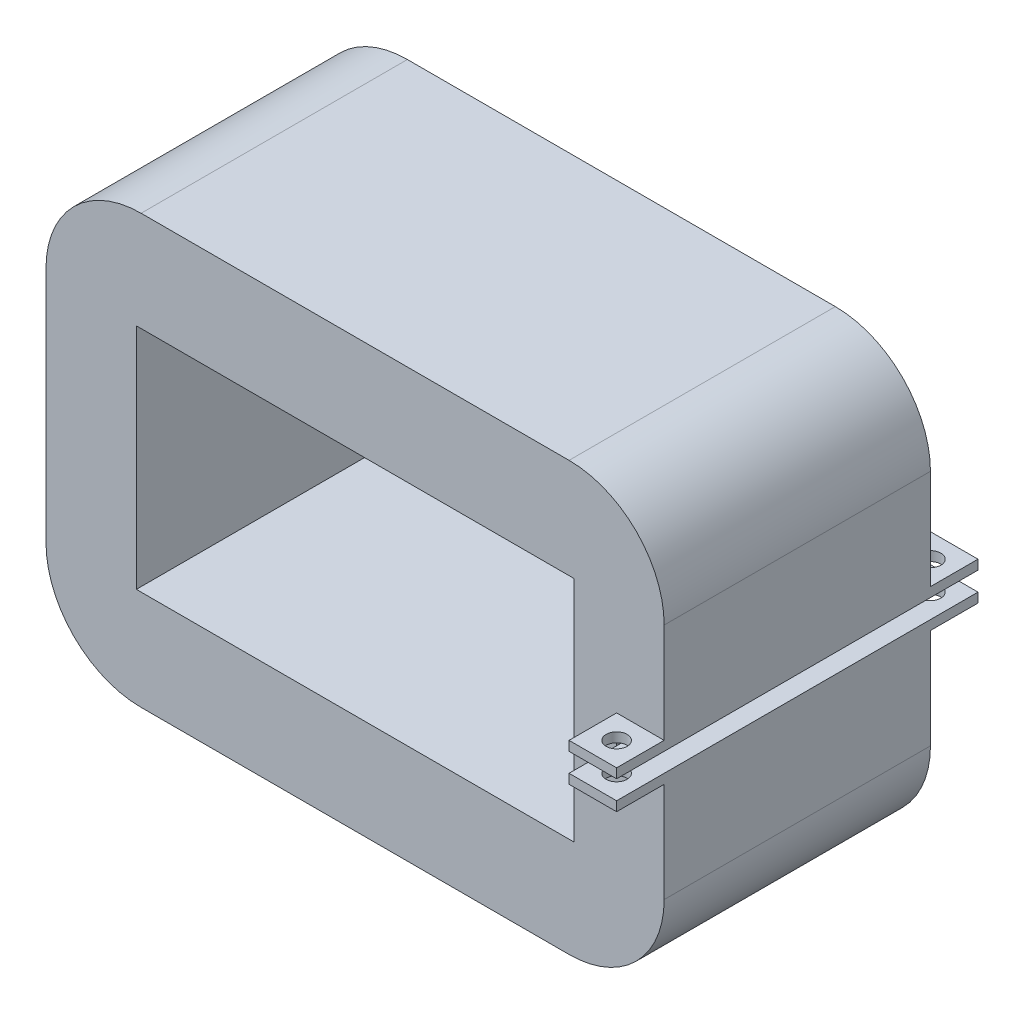
ISO-10303-21;
HEADER;
FILE_DESCRIPTION(('STEP AP214'),'2;1');
FILE_NAME('part.step','',(''),(''),'','','');
FILE_SCHEMA(('AUTOMOTIVE_DESIGN { 1 0 10303 214 1 1 1 1 }'));
ENDSEC;
DATA;
#1=APPLICATION_CONTEXT('core data for automotive mechanical design processes');
#2=APPLICATION_PROTOCOL_DEFINITION('international standard','automotive_design',2000,#1);
#3=PRODUCT_CONTEXT('',#1,'mechanical');
#4=PRODUCT('Part','Part','',(#3));
#5=PRODUCT_RELATED_PRODUCT_CATEGORY('part','',(#4));
#6=PRODUCT_DEFINITION_FORMATION('','',#4);
#7=PRODUCT_DEFINITION_CONTEXT('part definition',#1,'design');
#8=PRODUCT_DEFINITION('design','',#6,#7);
#9=PRODUCT_DEFINITION_SHAPE('','',#8);
#10=(LENGTH_UNIT() NAMED_UNIT(*) SI_UNIT(.MILLI.,.METRE.));
#11=(NAMED_UNIT(*) PLANE_ANGLE_UNIT() SI_UNIT($,.RADIAN.));
#12=(NAMED_UNIT(*) SI_UNIT($,.STERADIAN.) SOLID_ANGLE_UNIT());
#13=UNCERTAINTY_MEASURE_WITH_UNIT(LENGTH_MEASURE(1.E-05),#10,'distance_accuracy_value','');
#14=(GEOMETRIC_REPRESENTATION_CONTEXT(3) GLOBAL_UNCERTAINTY_ASSIGNED_CONTEXT((#13)) GLOBAL_UNIT_ASSIGNED_CONTEXT((#10,
#11,#12)) REPRESENTATION_CONTEXT('',''));
#15=CARTESIAN_POINT('',(0.,0.,0.));
#16=DIRECTION('',(0.,0.,1.));
#17=DIRECTION('',(1.,0.,0.));
#18=AXIS2_PLACEMENT_3D('',#15,#16,#17);
#19=CARTESIAN_POINT('',(5.06534472825042,22.5,28.));
#20=DIRECTION('',(-1.,0.,0.));
#21=DIRECTION('',(0.,-1.,0.));
#22=AXIS2_PLACEMENT_3D('',#19,#20,#21);
#23=PLANE('',#22);
#24=DIRECTION('',(0.,0.,-1.));
#25=VECTOR('',#24,1.);
#26=CARTESIAN_POINT('',(5.06534472825043,-1.,28.));
#27=LINE('',#26,#25);
#28=CARTESIAN_POINT('',(5.06534472825043,-1.,33.));
#29=VERTEX_POINT('',#28);
#30=CARTESIAN_POINT('',(5.06534472825043,-1.,-5.));
#31=VERTEX_POINT('',#30);
#32=EDGE_CURVE('E329',#29,#31,#27,.T.);
#33=ORIENTED_EDGE('',*,*,#32,.F.);
#34=DIRECTION('',(0.,1.,0.));
#35=VECTOR('',#34,1.);
#36=CARTESIAN_POINT('',(5.06534472825043,-1.,33.));
#37=LINE('',#36,#35);
#38=CARTESIAN_POINT('',(5.06534472825043,-2.,33.));
#39=VERTEX_POINT('',#38);
#40=EDGE_CURVE('E506',#39,#29,#37,.T.);
#41=ORIENTED_EDGE('',*,*,#40,.F.);
#42=DIRECTION('',(0.,0.,1.));
#43=VECTOR('',#42,1.);
#44=CARTESIAN_POINT('',(5.06534472825043,-2.,28.));
#45=LINE('',#44,#43);
#46=CARTESIAN_POINT('',(5.06534472825043,-2.,28.));
#47=VERTEX_POINT('',#46);
#48=EDGE_CURVE('E351',#47,#39,#45,.T.);
#49=ORIENTED_EDGE('',*,*,#48,.F.);
#50=DIRECTION('',(0.,1.,0.));
#51=VECTOR('',#50,1.);
#52=CARTESIAN_POINT('',(5.06534472825042,22.5,28.));
#53=LINE('',#52,#51);
#54=CARTESIAN_POINT('',(5.06534472825043,-12.5,28.));
#55=VERTEX_POINT('',#54);
#56=EDGE_CURVE('E243',#55,#47,#53,.T.);
#57=ORIENTED_EDGE('',*,*,#56,.F.);
#58=DIRECTION('',(0.,0.,1.));
#59=VECTOR('',#58,1.);
#60=CARTESIAN_POINT('',(5.06534472825043,-12.5,28.));
#61=LINE('',#60,#59);
#62=CARTESIAN_POINT('',(5.06534472825043,-12.5,0.));
#63=VERTEX_POINT('',#62);
#64=EDGE_CURVE('E319',#55,#63,#61,.F.);
#65=ORIENTED_EDGE('',*,*,#64,.T.);
#66=DIRECTION('',(0.,1.,0.));
#67=VECTOR('',#66,1.);
#68=CARTESIAN_POINT('',(5.06534472825042,22.5,0.));
#69=LINE('',#68,#67);
#70=CARTESIAN_POINT('',(5.06534472825043,-1.99999999999999,0.));
#71=VERTEX_POINT('',#70);
#72=EDGE_CURVE('E266',#63,#71,#69,.T.);
#73=ORIENTED_EDGE('',*,*,#72,.T.);
#74=DIRECTION('',(0.,0.,1.));
#75=VECTOR('',#74,1.);
#76=CARTESIAN_POINT('',(5.06534472825043,-2.,-5.));
#77=LINE('',#76,#75);
#78=CARTESIAN_POINT('',(5.06534472825043,-2.,-5.));
#79=VERTEX_POINT('',#78);
#80=EDGE_CURVE('E421',#79,#71,#77,.T.);
#81=ORIENTED_EDGE('',*,*,#80,.F.);
#82=DIRECTION('',(0.,1.,0.));
#83=VECTOR('',#82,1.);
#84=CARTESIAN_POINT('',(5.06534472825043,-1.,-5.));
#85=LINE('',#84,#83);
#86=EDGE_CURVE('E402',#79,#31,#85,.T.);
#87=ORIENTED_EDGE('',*,*,#86,.T.);
#88=EDGE_LOOP('',(#33,#41,#49,#57,#65,#73,#81,#87));
#89=FACE_BOUND('',#88,.T.);
#90=ADVANCED_FACE('F38',(#89),#23,.F.);
#91=CARTESIAN_POINT('',(-4.93465527174958,-12.5,28.));
#92=DIRECTION('',(0.,0.,1.));
#93=DIRECTION('',(1.,0.,0.));
#94=AXIS2_PLACEMENT_3D('',#91,#92,#93);
#95=CYLINDRICAL_SURFACE('',#94,10.);
#96=DIRECTION('',(0.,0.,1.));
#97=VECTOR('',#96,1.);
#98=CARTESIAN_POINT('',(-4.93465527174958,-22.5,28.));
#99=LINE('',#98,#97);
#100=CARTESIAN_POINT('',(-4.93465527174957,-22.5,0.));
#101=VERTEX_POINT('',#100);
#102=CARTESIAN_POINT('',(-4.93465527174957,-22.5,28.));
#103=VERTEX_POINT('',#102);
#104=EDGE_CURVE('E315',#101,#103,#99,.T.);
#105=ORIENTED_EDGE('',*,*,#104,.F.);
#106=CARTESIAN_POINT('',(-4.93465527174958,-12.5,0.));
#107=DIRECTION('',(0.,0.,1.));
#108=DIRECTION('',(1.,0.,0.));
#109=AXIS2_PLACEMENT_3D('',#106,#107,#108);
#110=CIRCLE('',#109,10.);
#111=EDGE_CURVE('E323',#63,#101,#110,.F.);
#112=ORIENTED_EDGE('',*,*,#111,.F.);
#113=ORIENTED_EDGE('',*,*,#64,.F.);
#114=CARTESIAN_POINT('',(-4.93465527174958,-12.5,28.));
#115=DIRECTION('',(0.,0.,1.));
#116=DIRECTION('',(1.,0.,0.));
#117=AXIS2_PLACEMENT_3D('',#114,#115,#116);
#118=CIRCLE('',#117,10.);
#119=EDGE_CURVE('E326',#103,#55,#118,.T.);
#120=ORIENTED_EDGE('',*,*,#119,.F.);
#121=EDGE_LOOP('',(#105,#112,#113,#120));
#122=FACE_BOUND('',#121,.T.);
#123=ADVANCED_FACE('F40',(#122),#95,.T.);
#124=CARTESIAN_POINT('',(-4.93465527174958,12.5,28.));
#125=DIRECTION('',(0.,0.,-1.));
#126=DIRECTION('',(-1.,0.,0.));
#127=AXIS2_PLACEMENT_3D('',#124,#125,#126);
#128=CYLINDRICAL_SURFACE('',#127,10.);
#129=DIRECTION('',(0.,0.,-1.));
#130=VECTOR('',#129,1.);
#131=CARTESIAN_POINT('',(-4.93465527174958,22.5,28.));
#132=LINE('',#131,#130);
#133=CARTESIAN_POINT('',(-4.93465527174958,22.5,28.));
#134=VERTEX_POINT('',#133);
#135=CARTESIAN_POINT('',(-4.93465527174958,22.5,0.));
#136=VERTEX_POINT('',#135);
#137=EDGE_CURVE('E302',#134,#136,#132,.T.);
#138=ORIENTED_EDGE('',*,*,#137,.F.);
#139=CARTESIAN_POINT('',(-4.93465527174958,12.5,28.));
#140=DIRECTION('',(0.,0.,1.));
#141=DIRECTION('',(1.,0.,0.));
#142=AXIS2_PLACEMENT_3D('',#139,#140,#141);
#143=CIRCLE('',#142,10.);
#144=CARTESIAN_POINT('',(5.06534472825042,12.5,28.));
#145=VERTEX_POINT('',#144);
#146=EDGE_CURVE('E308',#145,#134,#143,.T.);
#147=ORIENTED_EDGE('',*,*,#146,.F.);
#148=DIRECTION('',(0.,0.,-1.));
#149=VECTOR('',#148,1.);
#150=CARTESIAN_POINT('',(5.06534472825042,12.5,28.));
#151=LINE('',#150,#149);
#152=CARTESIAN_POINT('',(5.06534472825042,12.5,0.));
#153=VERTEX_POINT('',#152);
#154=EDGE_CURVE('E241',#153,#145,#151,.F.);
#155=ORIENTED_EDGE('',*,*,#154,.F.);
#156=CARTESIAN_POINT('',(-4.93465527174958,12.5,0.));
#157=DIRECTION('',(0.,0.,1.));
#158=DIRECTION('',(1.,0.,0.));
#159=AXIS2_PLACEMENT_3D('',#156,#157,#158);
#160=CIRCLE('',#159,10.);
#161=EDGE_CURVE('E311',#136,#153,#160,.F.);
#162=ORIENTED_EDGE('',*,*,#161,.F.);
#163=EDGE_LOOP('',(#138,#147,#155,#162));
#164=FACE_BOUND('',#163,.T.);
#165=ADVANCED_FACE('F609',(#164),#128,.T.);
#166=CARTESIAN_POINT('',(-49.9346552717496,12.5,28.));
#167=DIRECTION('',(0.,0.,1.));
#168=DIRECTION('',(1.,0.,0.));
#169=AXIS2_PLACEMENT_3D('',#166,#167,#168);
#170=CYLINDRICAL_SURFACE('',#169,10.);
#171=DIRECTION('',(0.,0.,1.));
#172=VECTOR('',#171,1.);
#173=CARTESIAN_POINT('',(-49.9346552717496,22.5,28.));
#174=LINE('',#173,#172);
#175=CARTESIAN_POINT('',(-49.9346552717496,22.5,0.));
#176=VERTEX_POINT('',#175);
#177=CARTESIAN_POINT('',(-49.9346552717496,22.5,28.));
#178=VERTEX_POINT('',#177);
#179=EDGE_CURVE('E287',#176,#178,#174,.T.);
#180=ORIENTED_EDGE('',*,*,#179,.F.);
#181=CARTESIAN_POINT('',(-49.9346552717496,12.5,0.));
#182=DIRECTION('',(0.,0.,1.));
#183=DIRECTION('',(1.,0.,0.));
#184=AXIS2_PLACEMENT_3D('',#181,#182,#183);
#185=CIRCLE('',#184,10.);
#186=CARTESIAN_POINT('',(-59.9346552717496,12.5,0.));
#187=VERTEX_POINT('',#186);
#188=EDGE_CURVE('E295',#187,#176,#185,.F.);
#189=ORIENTED_EDGE('',*,*,#188,.F.);
#190=DIRECTION('',(0.,0.,1.));
#191=VECTOR('',#190,1.);
#192=CARTESIAN_POINT('',(-59.9346552717496,12.5,28.));
#193=LINE('',#192,#191);
#194=CARTESIAN_POINT('',(-59.9346552717496,12.5,28.));
#195=VERTEX_POINT('',#194);
#196=EDGE_CURVE('E291',#195,#187,#193,.F.);
#197=ORIENTED_EDGE('',*,*,#196,.F.);
#198=CARTESIAN_POINT('',(-49.9346552717496,12.5,28.));
#199=DIRECTION('',(0.,0.,1.));
#200=DIRECTION('',(1.,0.,0.));
#201=AXIS2_PLACEMENT_3D('',#198,#199,#200);
#202=CIRCLE('',#201,10.);
#203=EDGE_CURVE('E299',#178,#195,#202,.T.);
#204=ORIENTED_EDGE('',*,*,#203,.F.);
#205=EDGE_LOOP('',(#180,#189,#197,#204));
#206=FACE_BOUND('',#205,.T.);
#207=ADVANCED_FACE('F627',(#206),#170,.T.);
#208=CARTESIAN_POINT('',(-49.9346552717496,-12.5,28.));
#209=DIRECTION('',(0.,0.,1.));
#210=DIRECTION('',(1.,0.,0.));
#211=AXIS2_PLACEMENT_3D('',#208,#209,#210);
#212=CYLINDRICAL_SURFACE('',#211,10.);
#213=DIRECTION('',(0.,0.,1.));
#214=VECTOR('',#213,1.);
#215=CARTESIAN_POINT('',(-59.9346552717496,-12.5,28.));
#216=LINE('',#215,#214);
#217=CARTESIAN_POINT('',(-59.9346552717496,-12.5,0.));
#218=VERTEX_POINT('',#217);
#219=CARTESIAN_POINT('',(-59.9346552717496,-12.5,28.));
#220=VERTEX_POINT('',#219);
#221=EDGE_CURVE('E256',#218,#220,#216,.T.);
#222=ORIENTED_EDGE('',*,*,#221,.F.);
#223=CARTESIAN_POINT('',(-49.9346552717496,-12.5,0.));
#224=DIRECTION('',(0.,0.,1.));
#225=DIRECTION('',(1.,0.,0.));
#226=AXIS2_PLACEMENT_3D('',#223,#224,#225);
#227=CIRCLE('',#226,10.);
#228=CARTESIAN_POINT('',(-49.9346552717496,-22.5,0.));
#229=VERTEX_POINT('',#228);
#230=EDGE_CURVE('E280',#229,#218,#227,.F.);
#231=ORIENTED_EDGE('',*,*,#230,.F.);
#232=DIRECTION('',(0.,0.,1.));
#233=VECTOR('',#232,1.);
#234=CARTESIAN_POINT('',(-49.9346552717496,-22.5,28.));
#235=LINE('',#234,#233);
#236=CARTESIAN_POINT('',(-49.9346552717496,-22.5,28.));
#237=VERTEX_POINT('',#236);
#238=EDGE_CURVE('E276',#237,#229,#235,.F.);
#239=ORIENTED_EDGE('',*,*,#238,.F.);
#240=CARTESIAN_POINT('',(-49.9346552717496,-12.5,28.));
#241=DIRECTION('',(0.,0.,1.));
#242=DIRECTION('',(1.,0.,0.));
#243=AXIS2_PLACEMENT_3D('',#240,#241,#242);
#244=CIRCLE('',#243,10.);
#245=EDGE_CURVE('E284',#220,#237,#244,.T.);
#246=ORIENTED_EDGE('',*,*,#245,.F.);
#247=EDGE_LOOP('',(#222,#231,#239,#246));
#248=FACE_BOUND('',#247,.T.);
#249=ADVANCED_FACE('F488',(#248),#212,.T.);
#250=CARTESIAN_POINT('',(0.,0.,28.));
#251=DIRECTION('',(0.,0.,1.));
#252=DIRECTION('',(1.,0.,0.));
#253=AXIS2_PLACEMENT_3D('',#250,#251,#252);
#254=PLANE('',#253);
#255=DIRECTION('',(0.,-1.,0.));
#256=VECTOR('',#255,1.);
#257=CARTESIAN_POINT('',(0.0653447282504237,1.,28.));
#258=LINE('',#257,#256);
#259=CARTESIAN_POINT('',(0.0653447282504237,2.,28.));
#260=VERTEX_POINT('',#259);
#261=CARTESIAN_POINT('',(0.0653447282504237,1.,28.));
#262=VERTEX_POINT('',#261);
#263=EDGE_CURVE('E235',#260,#262,#258,.T.);
#264=ORIENTED_EDGE('',*,*,#263,.F.);
#265=DIRECTION('',(-1.,0.,0.));
#266=VECTOR('',#265,1.);
#267=CARTESIAN_POINT('',(0.0653447282504237,2.,28.));
#268=LINE('',#267,#266);
#269=CARTESIAN_POINT('',(5.06534472825042,2.,28.));
#270=VERTEX_POINT('',#269);
#271=EDGE_CURVE('E218',#270,#260,#268,.T.);
#272=ORIENTED_EDGE('',*,*,#271,.F.);
#273=EDGE_CURVE('E232',#270,#145,#53,.T.);
#274=ORIENTED_EDGE('',*,*,#273,.T.);
#275=ORIENTED_EDGE('',*,*,#146,.T.);
#276=DIRECTION('',(-1.,0.,0.));
#277=VECTOR('',#276,1.);
#278=CARTESIAN_POINT('',(-59.9346552717496,22.5,28.));
#279=LINE('',#278,#277);
#280=EDGE_CURVE('E248',#134,#178,#279,.T.);
#281=ORIENTED_EDGE('',*,*,#280,.T.);
#282=ORIENTED_EDGE('',*,*,#203,.T.);
#283=DIRECTION('',(0.,-1.,0.));
#284=VECTOR('',#283,1.);
#285=CARTESIAN_POINT('',(-59.9346552717496,22.5,28.));
#286=LINE('',#285,#284);
#287=EDGE_CURVE('E250',#195,#220,#286,.T.);
#288=ORIENTED_EDGE('',*,*,#287,.T.);
#289=ORIENTED_EDGE('',*,*,#245,.T.);
#290=DIRECTION('',(1.,0.,0.));
#291=VECTOR('',#290,1.);
#292=CARTESIAN_POINT('',(-59.9346552717496,-22.5,28.));
#293=LINE('',#292,#291);
#294=EDGE_CURVE('E244',#237,#103,#293,.T.);
#295=ORIENTED_EDGE('',*,*,#294,.T.);
#296=ORIENTED_EDGE('',*,*,#119,.T.);
#297=ORIENTED_EDGE('',*,*,#56,.T.);
#298=DIRECTION('',(1.,0.,0.));
#299=VECTOR('',#298,1.);
#300=CARTESIAN_POINT('',(0.0653447282504238,-2.,28.));
#301=LINE('',#300,#299);
#302=CARTESIAN_POINT('',(0.0653447282504238,-2.,28.));
#303=VERTEX_POINT('',#302);
#304=EDGE_CURVE('E56',#303,#47,#301,.T.);
#305=ORIENTED_EDGE('',*,*,#304,.F.);
#306=DIRECTION('',(0.,-1.,0.));
#307=VECTOR('',#306,1.);
#308=CARTESIAN_POINT('',(0.0653447282504236,-1.,28.));
#309=LINE('',#308,#307);
#310=CARTESIAN_POINT('',(0.0653447282504236,-1.,28.));
#311=VERTEX_POINT('',#310);
#312=EDGE_CURVE('E514',#311,#303,#309,.T.);
#313=ORIENTED_EDGE('',*,*,#312,.F.);
#314=DIRECTION('',(0.,1.,0.));
#315=VECTOR('',#314,1.);
#316=CARTESIAN_POINT('',(0.0653447282504237,0.,28.));
#317=LINE('',#316,#315);
#318=EDGE_CURVE('E433',#311,#262,#317,.T.);
#319=ORIENTED_EDGE('',*,*,#318,.T.);
#320=EDGE_LOOP('',(#264,#272,#274,#275,#281,#282,#288,#289,#295,#296,#297,#305,#313,#319));
#321=FACE_BOUND('',#320,.T.);
#322=DIRECTION('',(-1.,0.,0.));
#323=VECTOR('',#322,1.);
#324=CARTESIAN_POINT('',(0.,-12.,28.));
#325=LINE('',#324,#323);
#326=CARTESIAN_POINT('',(-4.43465527174957,-12.,28.));
#327=VERTEX_POINT('',#326);
#328=CARTESIAN_POINT('',(-50.4346552717496,-12.,28.));
#329=VERTEX_POINT('',#328);
#330=EDGE_CURVE('E473',#327,#329,#325,.T.);
#331=ORIENTED_EDGE('',*,*,#330,.T.);
#332=DIRECTION('',(0.,1.,0.));
#333=VECTOR('',#332,1.);
#334=CARTESIAN_POINT('',(-50.4346552717496,0.,28.));
#335=LINE('',#334,#333);
#336=CARTESIAN_POINT('',(-50.4346552717496,12.,28.));
#337=VERTEX_POINT('',#336);
#338=EDGE_CURVE('E261',#329,#337,#335,.T.);
#339=ORIENTED_EDGE('',*,*,#338,.T.);
#340=DIRECTION('',(1.,0.,0.));
#341=VECTOR('',#340,1.);
#342=CARTESIAN_POINT('',(0.,12.,28.));
#343=LINE('',#342,#341);
#344=CARTESIAN_POINT('',(-4.43465527174958,12.,28.));
#345=VERTEX_POINT('',#344);
#346=EDGE_CURVE('E465',#337,#345,#343,.T.);
#347=ORIENTED_EDGE('',*,*,#346,.T.);
#348=DIRECTION('',(0.,-1.,0.));
#349=VECTOR('',#348,1.);
#350=CARTESIAN_POINT('',(-4.43465527174958,0.,28.));
#351=LINE('',#350,#349);
#352=EDGE_CURVE('E469',#345,#327,#351,.T.);
#353=ORIENTED_EDGE('',*,*,#352,.T.);
#354=EDGE_LOOP('',(#331,#339,#347,#353));
#355=FACE_BOUND('',#354,.T.);
#356=ADVANCED_FACE('F230',(#321,#355),#254,.T.);
#357=CARTESIAN_POINT('',(0.,0.,0.));
#358=DIRECTION('',(0.,0.,1.));
#359=DIRECTION('',(1.,0.,0.));
#360=AXIS2_PLACEMENT_3D('',#357,#358,#359);
#361=PLANE('',#360);
#362=DIRECTION('',(-1.,0.,0.));
#363=VECTOR('',#362,1.);
#364=CARTESIAN_POINT('',(0.0653447282504237,2.,0.));
#365=LINE('',#364,#363);
#366=CARTESIAN_POINT('',(5.06534472825042,2.00000000000001,0.));
#367=VERTEX_POINT('',#366);
#368=CARTESIAN_POINT('',(0.0653447282504237,2.,0.));
#369=VERTEX_POINT('',#368);
#370=EDGE_CURVE('E64',#367,#369,#365,.T.);
#371=ORIENTED_EDGE('',*,*,#370,.T.);
#372=DIRECTION('',(0.,-1.,0.));
#373=VECTOR('',#372,1.);
#374=CARTESIAN_POINT('',(0.0653447282504237,1.,0.));
#375=LINE('',#374,#373);
#376=CARTESIAN_POINT('',(0.0653447282504237,1.,0.));
#377=VERTEX_POINT('',#376);
#378=EDGE_CURVE('E360',#369,#377,#375,.T.);
#379=ORIENTED_EDGE('',*,*,#378,.T.);
#380=DIRECTION('',(0.,1.,0.));
#381=VECTOR('',#380,1.);
#382=CARTESIAN_POINT('',(0.0653447282504237,0.,0.));
#383=LINE('',#382,#381);
#384=CARTESIAN_POINT('',(0.0653447282504236,-1.,0.));
#385=VERTEX_POINT('',#384);
#386=EDGE_CURVE('E11',#385,#377,#383,.T.);
#387=ORIENTED_EDGE('',*,*,#386,.F.);
#388=DIRECTION('',(0.,-1.,0.));
#389=VECTOR('',#388,1.);
#390=CARTESIAN_POINT('',(0.0653447282504236,-1.,0.));
#391=LINE('',#390,#389);
#392=CARTESIAN_POINT('',(0.0653447282504238,-2.,0.));
#393=VERTEX_POINT('',#392);
#394=EDGE_CURVE('E385',#385,#393,#391,.T.);
#395=ORIENTED_EDGE('',*,*,#394,.T.);
#396=DIRECTION('',(1.,0.,0.));
#397=VECTOR('',#396,1.);
#398=CARTESIAN_POINT('',(0.0653447282504238,-2.,0.));
#399=LINE('',#398,#397);
#400=EDGE_CURVE('E398',#393,#71,#399,.T.);
#401=ORIENTED_EDGE('',*,*,#400,.T.);
#402=ORIENTED_EDGE('',*,*,#72,.F.);
#403=ORIENTED_EDGE('',*,*,#111,.T.);
#404=DIRECTION('',(1.,0.,0.));
#405=VECTOR('',#404,1.);
#406=CARTESIAN_POINT('',(-59.9346552717496,-22.5,0.));
#407=LINE('',#406,#405);
#408=EDGE_CURVE('E260',#229,#101,#407,.T.);
#409=ORIENTED_EDGE('',*,*,#408,.F.);
#410=ORIENTED_EDGE('',*,*,#230,.T.);
#411=DIRECTION('',(0.,-1.,0.));
#412=VECTOR('',#411,1.);
#413=CARTESIAN_POINT('',(-59.9346552717496,22.5,0.));
#414=LINE('',#413,#412);
#415=EDGE_CURVE('E257',#187,#218,#414,.T.);
#416=ORIENTED_EDGE('',*,*,#415,.F.);
#417=ORIENTED_EDGE('',*,*,#188,.T.);
#418=DIRECTION('',(-1.,0.,0.));
#419=VECTOR('',#418,1.);
#420=CARTESIAN_POINT('',(-59.9346552717496,22.5,0.));
#421=LINE('',#420,#419);
#422=EDGE_CURVE('E270',#136,#176,#421,.T.);
#423=ORIENTED_EDGE('',*,*,#422,.F.);
#424=ORIENTED_EDGE('',*,*,#161,.T.);
#425=EDGE_CURVE('E265',#367,#153,#69,.T.);
#426=ORIENTED_EDGE('',*,*,#425,.F.);
#427=EDGE_LOOP('',(#371,#379,#387,#395,#401,#402,#403,#409,#410,#416,#417,#423,#424,#426));
#428=FACE_BOUND('',#427,.T.);
#429=DIRECTION('',(0.,-1.,0.));
#430=VECTOR('',#429,1.);
#431=CARTESIAN_POINT('',(-50.4346552717496,12.,0.));
#432=LINE('',#431,#430);
#433=CARTESIAN_POINT('',(-50.4346552717496,12.,0.));
#434=VERTEX_POINT('',#433);
#435=CARTESIAN_POINT('',(-50.4346552717496,-12.,0.));
#436=VERTEX_POINT('',#435);
#437=EDGE_CURVE('E436',#434,#436,#432,.T.);
#438=ORIENTED_EDGE('',*,*,#437,.T.);
#439=DIRECTION('',(1.,0.,0.));
#440=VECTOR('',#439,1.);
#441=CARTESIAN_POINT('',(-50.4346552717496,-12.,0.));
#442=LINE('',#441,#440);
#443=CARTESIAN_POINT('',(-4.43465527174957,-12.,0.));
#444=VERTEX_POINT('',#443);
#445=EDGE_CURVE('E440',#436,#444,#442,.T.);
#446=ORIENTED_EDGE('',*,*,#445,.T.);
#447=DIRECTION('',(0.,1.,0.));
#448=VECTOR('',#447,1.);
#449=CARTESIAN_POINT('',(-4.43465527174958,12.,0.));
#450=LINE('',#449,#448);
#451=CARTESIAN_POINT('',(-4.43465527174958,12.,0.));
#452=VERTEX_POINT('',#451);
#453=EDGE_CURVE('E444',#444,#452,#450,.T.);
#454=ORIENTED_EDGE('',*,*,#453,.T.);
#455=DIRECTION('',(-1.,0.,0.));
#456=VECTOR('',#455,1.);
#457=CARTESIAN_POINT('',(-50.4346552717496,12.,0.));
#458=LINE('',#457,#456);
#459=EDGE_CURVE('E448',#452,#434,#458,.T.);
#460=ORIENTED_EDGE('',*,*,#459,.T.);
#461=EDGE_LOOP('',(#438,#446,#454,#460));
#462=FACE_BOUND('',#461,.T.);
#463=ADVANCED_FACE('F493',(#428,#462),#361,.F.);
#464=CARTESIAN_POINT('',(-59.9346552717496,22.5,28.));
#465=DIRECTION('',(1.,0.,0.));
#466=DIRECTION('',(0.,1.,0.));
#467=AXIS2_PLACEMENT_3D('',#464,#465,#466);
#468=PLANE('',#467);
#469=ORIENTED_EDGE('',*,*,#287,.F.);
#470=ORIENTED_EDGE('',*,*,#196,.T.);
#471=ORIENTED_EDGE('',*,*,#415,.T.);
#472=ORIENTED_EDGE('',*,*,#221,.T.);
#473=EDGE_LOOP('',(#469,#470,#471,#472));
#474=FACE_BOUND('',#473,.T.);
#475=ADVANCED_FACE('F490',(#474),#468,.F.);
#476=CARTESIAN_POINT('',(-59.9346552717496,-22.5,28.));
#477=DIRECTION('',(0.,1.,0.));
#478=DIRECTION('',(0.,0.,1.));
#479=AXIS2_PLACEMENT_3D('',#476,#477,#478);
#480=PLANE('',#479);
#481=ORIENTED_EDGE('',*,*,#408,.T.);
#482=ORIENTED_EDGE('',*,*,#104,.T.);
#483=ORIENTED_EDGE('',*,*,#294,.F.);
#484=ORIENTED_EDGE('',*,*,#238,.T.);
#485=EDGE_LOOP('',(#481,#482,#483,#484));
#486=FACE_BOUND('',#485,.T.);
#487=ADVANCED_FACE('F496',(#486),#480,.F.);
#488=ORIENTED_EDGE('',*,*,#273,.F.);
#489=DIRECTION('',(0.,0.,1.));
#490=VECTOR('',#489,1.);
#491=CARTESIAN_POINT('',(5.06534472825042,2.,28.));
#492=LINE('',#491,#490);
#493=CARTESIAN_POINT('',(5.06534472825042,2.,33.));
#494=VERTEX_POINT('',#493);
#495=EDGE_CURVE('E215',#270,#494,#492,.T.);
#496=ORIENTED_EDGE('',*,*,#495,.T.);
#497=DIRECTION('',(0.,1.,0.));
#498=VECTOR('',#497,1.);
#499=CARTESIAN_POINT('',(5.06534472825042,1.,33.));
#500=LINE('',#499,#498);
#501=CARTESIAN_POINT('',(5.06534472825042,1.,33.));
#502=VERTEX_POINT('',#501);
#503=EDGE_CURVE('E563',#502,#494,#500,.T.);
#504=ORIENTED_EDGE('',*,*,#503,.F.);
#505=DIRECTION('',(0.,0.,-1.));
#506=VECTOR('',#505,1.);
#507=CARTESIAN_POINT('',(5.06534472825042,1.,28.));
#508=LINE('',#507,#506);
#509=CARTESIAN_POINT('',(5.06534472825042,1.,-5.));
#510=VERTEX_POINT('',#509);
#511=EDGE_CURVE('E48',#502,#510,#508,.T.);
#512=ORIENTED_EDGE('',*,*,#511,.T.);
#513=DIRECTION('',(0.,1.,0.));
#514=VECTOR('',#513,1.);
#515=CARTESIAN_POINT('',(5.06534472825042,1.,-5.));
#516=LINE('',#515,#514);
#517=CARTESIAN_POINT('',(5.06534472825042,2.,-5.));
#518=VERTEX_POINT('',#517);
#519=EDGE_CURVE('E369',#510,#518,#516,.T.);
#520=ORIENTED_EDGE('',*,*,#519,.T.);
#521=DIRECTION('',(0.,0.,1.));
#522=VECTOR('',#521,1.);
#523=CARTESIAN_POINT('',(5.06534472825042,2.,-5.));
#524=LINE('',#523,#522);
#525=EDGE_CURVE('E386',#518,#367,#524,.T.);
#526=ORIENTED_EDGE('',*,*,#525,.T.);
#527=ORIENTED_EDGE('',*,*,#425,.T.);
#528=ORIENTED_EDGE('',*,*,#154,.T.);
#529=EDGE_LOOP('',(#488,#496,#504,#512,#520,#526,#527,#528));
#530=FACE_BOUND('',#529,.T.);
#531=ADVANCED_FACE('F239',(#530),#23,.F.);
#532=CARTESIAN_POINT('',(-59.9346552717496,22.5,28.));
#533=DIRECTION('',(0.,-1.,0.));
#534=DIRECTION('',(1.,0.,0.));
#535=AXIS2_PLACEMENT_3D('',#532,#533,#534);
#536=PLANE('',#535);
#537=ORIENTED_EDGE('',*,*,#280,.F.);
#538=ORIENTED_EDGE('',*,*,#137,.T.);
#539=ORIENTED_EDGE('',*,*,#422,.T.);
#540=ORIENTED_EDGE('',*,*,#179,.T.);
#541=EDGE_LOOP('',(#537,#538,#539,#540));
#542=FACE_BOUND('',#541,.T.);
#543=ADVANCED_FACE('F613',(#542),#536,.F.);
#544=CARTESIAN_POINT('',(-50.4346552717496,12.,39.));
#545=DIRECTION('',(1.,0.,0.));
#546=DIRECTION('',(0.,0.,-1.));
#547=AXIS2_PLACEMENT_3D('',#544,#545,#546);
#548=PLANE('',#547);
#549=DIRECTION('',(0.,0.,-1.));
#550=VECTOR('',#549,1.);
#551=CARTESIAN_POINT('',(-50.4346552717496,-12.,39.));
#552=LINE('',#551,#550);
#553=EDGE_CURVE('E462',#329,#436,#552,.T.);
#554=ORIENTED_EDGE('',*,*,#553,.T.);
#555=ORIENTED_EDGE('',*,*,#437,.F.);
#556=DIRECTION('',(0.,0.,-1.));
#557=VECTOR('',#556,1.);
#558=CARTESIAN_POINT('',(-50.4346552717496,12.,39.));
#559=LINE('',#558,#557);
#560=EDGE_CURVE('E452',#337,#434,#559,.T.);
#561=ORIENTED_EDGE('',*,*,#560,.F.);
#562=ORIENTED_EDGE('',*,*,#338,.F.);
#563=EDGE_LOOP('',(#554,#555,#561,#562));
#564=FACE_BOUND('',#563,.T.);
#565=ADVANCED_FACE('F618',(#564),#548,.T.);
#566=CARTESIAN_POINT('',(-50.4346552717496,-12.,39.));
#567=DIRECTION('',(0.,1.,0.));
#568=DIRECTION('',(-1.,0.,0.));
#569=AXIS2_PLACEMENT_3D('',#566,#567,#568);
#570=PLANE('',#569);
#571=DIRECTION('',(0.,0.,-1.));
#572=VECTOR('',#571,1.);
#573=CARTESIAN_POINT('',(-4.43465527174957,-12.,39.));
#574=LINE('',#573,#572);
#575=EDGE_CURVE('E459',#327,#444,#574,.T.);
#576=ORIENTED_EDGE('',*,*,#575,.T.);
#577=ORIENTED_EDGE('',*,*,#445,.F.);
#578=ORIENTED_EDGE('',*,*,#553,.F.);
#579=ORIENTED_EDGE('',*,*,#330,.F.);
#580=EDGE_LOOP('',(#576,#577,#578,#579));
#581=FACE_BOUND('',#580,.T.);
#582=ADVANCED_FACE('F687',(#581),#570,.T.);
#583=CARTESIAN_POINT('',(-4.43465527174958,12.,39.));
#584=DIRECTION('',(-1.,0.,0.));
#585=DIRECTION('',(0.,-1.,0.));
#586=AXIS2_PLACEMENT_3D('',#583,#584,#585);
#587=PLANE('',#586);
#588=DIRECTION('',(0.,0.,-1.));
#589=VECTOR('',#588,1.);
#590=CARTESIAN_POINT('',(-4.43465527174958,12.,39.));
#591=LINE('',#590,#589);
#592=EDGE_CURVE('E456',#345,#452,#591,.T.);
#593=ORIENTED_EDGE('',*,*,#592,.T.);
#594=ORIENTED_EDGE('',*,*,#453,.F.);
#595=ORIENTED_EDGE('',*,*,#575,.F.);
#596=ORIENTED_EDGE('',*,*,#352,.F.);
#597=EDGE_LOOP('',(#593,#594,#595,#596));
#598=FACE_BOUND('',#597,.T.);
#599=ADVANCED_FACE('F683',(#598),#587,.T.);
#600=CARTESIAN_POINT('',(-50.4346552717496,12.,39.));
#601=DIRECTION('',(0.,-1.,0.));
#602=DIRECTION('',(0.,0.,-1.));
#603=AXIS2_PLACEMENT_3D('',#600,#601,#602);
#604=PLANE('',#603);
#605=ORIENTED_EDGE('',*,*,#560,.T.);
#606=ORIENTED_EDGE('',*,*,#459,.F.);
#607=ORIENTED_EDGE('',*,*,#592,.F.);
#608=ORIENTED_EDGE('',*,*,#346,.F.);
#609=EDGE_LOOP('',(#605,#606,#607,#608));
#610=FACE_BOUND('',#609,.T.);
#611=ADVANCED_FACE('F680',(#610),#604,.T.);
#612=CARTESIAN_POINT('',(0.0653447282504237,1.,-3.31208002210381));
#613=DIRECTION('',(1.,0.,0.));
#614=DIRECTION('',(0.,1.,0.));
#615=AXIS2_PLACEMENT_3D('',#612,#613,#614);
#616=PLANE('',#615);
#617=DIRECTION('',(0.,0.,1.));
#618=VECTOR('',#617,1.);
#619=CARTESIAN_POINT('',(0.0653447282504236,-1.,-3.31208002210381));
#620=LINE('',#619,#618);
#621=EDGE_CURVE('E420',#385,#311,#620,.T.);
#622=ORIENTED_EDGE('',*,*,#621,.F.);
#623=ORIENTED_EDGE('',*,*,#386,.T.);
#624=DIRECTION('',(0.,0.,1.));
#625=VECTOR('',#624,1.);
#626=CARTESIAN_POINT('',(0.0653447282504237,1.,-3.31208002210381));
#627=LINE('',#626,#625);
#628=EDGE_CURVE('E429',#377,#262,#627,.T.);
#629=ORIENTED_EDGE('',*,*,#628,.T.);
#630=ORIENTED_EDGE('',*,*,#318,.F.);
#631=EDGE_LOOP('',(#622,#623,#629,#630));
#632=FACE_BOUND('',#631,.T.);
#633=ADVANCED_FACE('F545',(#632),#616,.T.);
#634=CARTESIAN_POINT('',(0.,1.,0.));
#635=DIRECTION('',(0.,1.,0.));
#636=DIRECTION('',(-1.,0.,0.));
#637=AXIS2_PLACEMENT_3D('',#634,#635,#636);
#638=PLANE('',#637);
#639=CARTESIAN_POINT('',(2.56534472825042,1.,30.5));
#640=DIRECTION('',(0.,1.,0.));
#641=DIRECTION('',(-1.,0.,0.));
#642=AXIS2_PLACEMENT_3D('',#639,#640,#641);
#643=CIRCLE('',#642,1.1);
#644=CARTESIAN_POINT('',(1.46534472825043,1.,30.5));
#645=VERTEX_POINT('',#644);
#646=EDGE_CURVE('E570',#645,#645,#643,.T.);
#647=ORIENTED_EDGE('',*,*,#646,.T.);
#648=EDGE_LOOP('',(#647));
#649=FACE_BOUND('',#648,.T.);
#650=CARTESIAN_POINT('',(2.56534472825042,1.,-2.5));
#651=DIRECTION('',(0.,1.,0.));
#652=DIRECTION('',(-1.,0.,0.));
#653=AXIS2_PLACEMENT_3D('',#650,#651,#652);
#654=CIRCLE('',#653,1.1);
#655=CARTESIAN_POINT('',(1.46534472825043,1.,-2.5));
#656=VERTEX_POINT('',#655);
#657=EDGE_CURVE('E343',#656,#656,#654,.T.);
#658=ORIENTED_EDGE('',*,*,#657,.T.);
#659=EDGE_LOOP('',(#658));
#660=FACE_BOUND('',#659,.T.);
#661=ORIENTED_EDGE('',*,*,#511,.F.);
#662=DIRECTION('',(1.,0.,0.));
#663=VECTOR('',#662,1.);
#664=CARTESIAN_POINT('',(0.0653447282504237,1.,33.));
#665=LINE('',#664,#663);
#666=CARTESIAN_POINT('',(0.0653447282504237,1.,33.));
#667=VERTEX_POINT('',#666);
#668=EDGE_CURVE('E553',#667,#502,#665,.T.);
#669=ORIENTED_EDGE('',*,*,#668,.F.);
#670=DIRECTION('',(0.,0.,1.));
#671=VECTOR('',#670,1.);
#672=CARTESIAN_POINT('',(0.0653447282504237,1.,28.));
#673=LINE('',#672,#671);
#674=EDGE_CURVE('E228',#262,#667,#673,.T.);
#675=ORIENTED_EDGE('',*,*,#674,.F.);
#676=ORIENTED_EDGE('',*,*,#628,.F.);
#677=DIRECTION('',(0.,0.,1.));
#678=VECTOR('',#677,1.);
#679=CARTESIAN_POINT('',(0.0653447282504237,1.,-5.));
#680=LINE('',#679,#678);
#681=CARTESIAN_POINT('',(0.0653447282504237,1.,-5.));
#682=VERTEX_POINT('',#681);
#683=EDGE_CURVE('E377',#682,#377,#680,.T.);
#684=ORIENTED_EDGE('',*,*,#683,.F.);
#685=DIRECTION('',(1.,0.,0.));
#686=VECTOR('',#685,1.);
#687=CARTESIAN_POINT('',(0.0653447282504237,1.,-5.));
#688=LINE('',#687,#686);
#689=EDGE_CURVE('E365',#682,#510,#688,.T.);
#690=ORIENTED_EDGE('',*,*,#689,.T.);
#691=EDGE_LOOP('',(#661,#669,#675,#676,#684,#690));
#692=FACE_BOUND('',#691,.T.);
#693=ADVANCED_FACE('F549',(#649,#660,#692),#638,.F.);
#694=CARTESIAN_POINT('',(0.,-1.,0.));
#695=DIRECTION('',(0.,1.,0.));
#696=DIRECTION('',(-1.,0.,0.));
#697=AXIS2_PLACEMENT_3D('',#694,#695,#696);
#698=PLANE('',#697);
#699=CARTESIAN_POINT('',(2.56534472825042,-1.,30.5));
#700=DIRECTION('',(0.,1.,0.));
#701=DIRECTION('',(-1.,0.,0.));
#702=AXIS2_PLACEMENT_3D('',#699,#700,#701);
#703=CIRCLE('',#702,1.1);
#704=CARTESIAN_POINT('',(1.46534472825043,-1.,30.5));
#705=VERTEX_POINT('',#704);
#706=EDGE_CURVE('E577',#705,#705,#703,.T.);
#707=ORIENTED_EDGE('',*,*,#706,.F.);
#708=EDGE_LOOP('',(#707));
#709=FACE_BOUND('',#708,.T.);
#710=CARTESIAN_POINT('',(2.56534472825042,-1.,-2.5));
#711=DIRECTION('',(0.,1.,0.));
#712=DIRECTION('',(-1.,0.,0.));
#713=AXIS2_PLACEMENT_3D('',#710,#711,#712);
#714=CIRCLE('',#713,1.1);
#715=CARTESIAN_POINT('',(1.46534472825043,-1.,-2.5));
#716=VERTEX_POINT('',#715);
#717=EDGE_CURVE('E336',#716,#716,#714,.T.);
#718=ORIENTED_EDGE('',*,*,#717,.F.);
#719=EDGE_LOOP('',(#718));
#720=FACE_BOUND('',#719,.T.);
#721=ORIENTED_EDGE('',*,*,#32,.T.);
#722=DIRECTION('',(-1.,0.,0.));
#723=VECTOR('',#722,1.);
#724=CARTESIAN_POINT('',(0.0653447282504236,-1.,-5.));
#725=LINE('',#724,#723);
#726=CARTESIAN_POINT('',(0.0653447282504236,-1.,-5.));
#727=VERTEX_POINT('',#726);
#728=EDGE_CURVE('E406',#31,#727,#725,.T.);
#729=ORIENTED_EDGE('',*,*,#728,.T.);
#730=DIRECTION('',(0.,0.,1.));
#731=VECTOR('',#730,1.);
#732=CARTESIAN_POINT('',(0.0653447282504236,-1.,-5.));
#733=LINE('',#732,#731);
#734=EDGE_CURVE('E417',#727,#385,#733,.T.);
#735=ORIENTED_EDGE('',*,*,#734,.T.);
#736=ORIENTED_EDGE('',*,*,#621,.T.);
#737=DIRECTION('',(0.,0.,1.));
#738=VECTOR('',#737,1.);
#739=CARTESIAN_POINT('',(0.0653447282504236,-1.,28.));
#740=LINE('',#739,#738);
#741=CARTESIAN_POINT('',(0.0653447282504236,-1.,33.));
#742=VERTEX_POINT('',#741);
#743=EDGE_CURVE('E346',#311,#742,#740,.T.);
#744=ORIENTED_EDGE('',*,*,#743,.T.);
#745=DIRECTION('',(-1.,0.,0.));
#746=VECTOR('',#745,1.);
#747=CARTESIAN_POINT('',(0.0653447282504236,-1.,33.));
#748=LINE('',#747,#746);
#749=EDGE_CURVE('E518',#29,#742,#748,.T.);
#750=ORIENTED_EDGE('',*,*,#749,.F.);
#751=EDGE_LOOP('',(#721,#729,#735,#736,#744,#750));
#752=FACE_BOUND('',#751,.T.);
#753=ADVANCED_FACE('F538',(#709,#720,#752),#698,.T.);
#754=CARTESIAN_POINT('',(0.0653447282504236,-1.,-5.));
#755=DIRECTION('',(-1.,0.,0.));
#756=DIRECTION('',(0.,-1.,0.));
#757=AXIS2_PLACEMENT_3D('',#754,#755,#756);
#758=PLANE('',#757);
#759=ORIENTED_EDGE('',*,*,#394,.F.);
#760=ORIENTED_EDGE('',*,*,#734,.F.);
#761=DIRECTION('',(0.,-1.,0.));
#762=VECTOR('',#761,1.);
#763=CARTESIAN_POINT('',(0.0653447282504236,-1.,-5.));
#764=LINE('',#763,#762);
#765=CARTESIAN_POINT('',(0.0653447282504238,-2.,-5.));
#766=VERTEX_POINT('',#765);
#767=EDGE_CURVE('E393',#727,#766,#764,.T.);
#768=ORIENTED_EDGE('',*,*,#767,.T.);
#769=DIRECTION('',(0.,0.,1.));
#770=VECTOR('',#769,1.);
#771=CARTESIAN_POINT('',(0.0653447282504238,-2.,-5.));
#772=LINE('',#771,#770);
#773=EDGE_CURVE('E410',#766,#393,#772,.T.);
#774=ORIENTED_EDGE('',*,*,#773,.T.);
#775=EDGE_LOOP('',(#759,#760,#768,#774));
#776=FACE_BOUND('',#775,.T.);
#777=ADVANCED_FACE('F650',(#776),#758,.T.);
#778=CARTESIAN_POINT('',(0.0653447282504238,-2.,-5.));
#779=DIRECTION('',(0.,-1.,0.));
#780=DIRECTION('',(0.,0.,-1.));
#781=AXIS2_PLACEMENT_3D('',#778,#779,#780);
#782=PLANE('',#781);
#783=CARTESIAN_POINT('',(2.56534472825042,-2.,-2.5));
#784=DIRECTION('',(0.,-1.,0.));
#785=DIRECTION('',(0.,0.,-1.));
#786=AXIS2_PLACEMENT_3D('',#783,#784,#785);
#787=CIRCLE('',#786,1.1);
#788=CARTESIAN_POINT('',(2.56534472825042,-2.,-3.6));
#789=VERTEX_POINT('',#788);
#790=EDGE_CURVE('E337',#789,#789,#787,.T.);
#791=ORIENTED_EDGE('',*,*,#790,.F.);
#792=EDGE_LOOP('',(#791));
#793=FACE_BOUND('',#792,.T.);
#794=ORIENTED_EDGE('',*,*,#400,.F.);
#795=ORIENTED_EDGE('',*,*,#773,.F.);
#796=DIRECTION('',(1.,0.,0.));
#797=VECTOR('',#796,1.);
#798=CARTESIAN_POINT('',(0.0653447282504238,-2.,-5.));
#799=LINE('',#798,#797);
#800=EDGE_CURVE('E397',#766,#79,#799,.T.);
#801=ORIENTED_EDGE('',*,*,#800,.T.);
#802=ORIENTED_EDGE('',*,*,#80,.T.);
#803=EDGE_LOOP('',(#794,#795,#801,#802));
#804=FACE_BOUND('',#803,.T.);
#805=ADVANCED_FACE('F654',(#793,#804),#782,.T.);
#806=CARTESIAN_POINT('',(0.,0.,-5.));
#807=DIRECTION('',(0.,0.,1.));
#808=DIRECTION('',(1.,0.,0.));
#809=AXIS2_PLACEMENT_3D('',#806,#807,#808);
#810=PLANE('',#809);
#811=ORIENTED_EDGE('',*,*,#767,.F.);
#812=ORIENTED_EDGE('',*,*,#728,.F.);
#813=ORIENTED_EDGE('',*,*,#86,.F.);
#814=ORIENTED_EDGE('',*,*,#800,.F.);
#815=EDGE_LOOP('',(#811,#812,#813,#814));
#816=FACE_BOUND('',#815,.T.);
#817=ADVANCED_FACE('F658',(#816),#810,.F.);
#818=CARTESIAN_POINT('',(0.0653447282504237,1.,-5.));
#819=DIRECTION('',(-1.,0.,0.));
#820=DIRECTION('',(0.,0.,1.));
#821=AXIS2_PLACEMENT_3D('',#818,#819,#820);
#822=PLANE('',#821);
#823=ORIENTED_EDGE('',*,*,#378,.F.);
#824=DIRECTION('',(0.,0.,1.));
#825=VECTOR('',#824,1.);
#826=CARTESIAN_POINT('',(0.0653447282504237,2.,-5.));
#827=LINE('',#826,#825);
#828=CARTESIAN_POINT('',(0.0653447282504237,2.,-5.));
#829=VERTEX_POINT('',#828);
#830=EDGE_CURVE('E382',#829,#369,#827,.T.);
#831=ORIENTED_EDGE('',*,*,#830,.F.);
#832=DIRECTION('',(0.,-1.,0.));
#833=VECTOR('',#832,1.);
#834=CARTESIAN_POINT('',(0.0653447282504237,1.,-5.));
#835=LINE('',#834,#833);
#836=EDGE_CURVE('E361',#829,#682,#835,.T.);
#837=ORIENTED_EDGE('',*,*,#836,.T.);
#838=ORIENTED_EDGE('',*,*,#683,.T.);
#839=EDGE_LOOP('',(#823,#831,#837,#838));
#840=FACE_BOUND('',#839,.T.);
#841=ADVANCED_FACE('F646',(#840),#822,.T.);
#842=CARTESIAN_POINT('',(0.0653447282504237,2.,-5.));
#843=DIRECTION('',(0.,1.,0.));
#844=DIRECTION('',(0.,0.,1.));
#845=AXIS2_PLACEMENT_3D('',#842,#843,#844);
#846=PLANE('',#845);
#847=CARTESIAN_POINT('',(2.56534472825042,2.,-2.5));
#848=DIRECTION('',(0.,1.,0.));
#849=DIRECTION('',(0.,0.,1.));
#850=AXIS2_PLACEMENT_3D('',#847,#848,#849);
#851=CIRCLE('',#850,1.1);
#852=CARTESIAN_POINT('',(2.56534472825042,2.,-1.4));
#853=VERTEX_POINT('',#852);
#854=EDGE_CURVE('E333',#853,#853,#851,.T.);
#855=ORIENTED_EDGE('',*,*,#854,.F.);
#856=EDGE_LOOP('',(#855));
#857=FACE_BOUND('',#856,.T.);
#858=ORIENTED_EDGE('',*,*,#370,.F.);
#859=ORIENTED_EDGE('',*,*,#525,.F.);
#860=DIRECTION('',(-1.,0.,0.));
#861=VECTOR('',#860,1.);
#862=CARTESIAN_POINT('',(0.0653447282504237,2.,-5.));
#863=LINE('',#862,#861);
#864=EDGE_CURVE('E373',#518,#829,#863,.T.);
#865=ORIENTED_EDGE('',*,*,#864,.T.);
#866=ORIENTED_EDGE('',*,*,#830,.T.);
#867=EDGE_LOOP('',(#858,#859,#865,#866));
#868=FACE_BOUND('',#867,.T.);
#869=ADVANCED_FACE('F642',(#857,#868),#846,.T.);
#870=CARTESIAN_POINT('',(0.,0.,-5.));
#871=DIRECTION('',(0.,0.,-1.));
#872=DIRECTION('',(-1.,0.,0.));
#873=AXIS2_PLACEMENT_3D('',#870,#871,#872);
#874=PLANE('',#873);
#875=ORIENTED_EDGE('',*,*,#836,.F.);
#876=ORIENTED_EDGE('',*,*,#864,.F.);
#877=ORIENTED_EDGE('',*,*,#519,.F.);
#878=ORIENTED_EDGE('',*,*,#689,.F.);
#879=EDGE_LOOP('',(#875,#876,#877,#878));
#880=FACE_BOUND('',#879,.T.);
#881=ADVANCED_FACE('F796',(#880),#874,.T.);
#882=CARTESIAN_POINT('',(2.56534472825042,3.,-2.5));
#883=DIRECTION('',(0.,-1.,0.));
#884=DIRECTION('',(0.,0.,-1.));
#885=AXIS2_PLACEMENT_3D('',#882,#883,#884);
#886=CYLINDRICAL_SURFACE('',#885,1.1);
#887=ORIENTED_EDGE('',*,*,#854,.T.);
#888=EDGE_LOOP('',(#887));
#889=FACE_BOUND('',#888,.T.);
#890=ORIENTED_EDGE('',*,*,#657,.F.);
#891=EDGE_LOOP('',(#890));
#892=FACE_BOUND('',#891,.T.);
#893=ADVANCED_FACE('F804',(#889,#892),#886,.F.);
#894=ORIENTED_EDGE('',*,*,#717,.T.);
#895=EDGE_LOOP('',(#894));
#896=FACE_BOUND('',#895,.T.);
#897=ORIENTED_EDGE('',*,*,#790,.T.);
#898=EDGE_LOOP('',(#897));
#899=FACE_BOUND('',#898,.T.);
#900=ADVANCED_FACE('F812',(#896,#899),#886,.F.);
#901=CARTESIAN_POINT('',(0.0653447282504236,-1.,28.));
#902=DIRECTION('',(-1.,0.,0.));
#903=DIRECTION('',(0.,-1.,0.));
#904=AXIS2_PLACEMENT_3D('',#901,#902,#903);
#905=PLANE('',#904);
#906=DIRECTION('',(0.,-1.,0.));
#907=VECTOR('',#906,1.);
#908=CARTESIAN_POINT('',(0.0653447282504236,-1.,33.));
#909=LINE('',#908,#907);
#910=CARTESIAN_POINT('',(0.0653447282504238,-2.,33.));
#911=VERTEX_POINT('',#910);
#912=EDGE_CURVE('E522',#742,#911,#909,.T.);
#913=ORIENTED_EDGE('',*,*,#912,.F.);
#914=ORIENTED_EDGE('',*,*,#743,.F.);
#915=ORIENTED_EDGE('',*,*,#312,.T.);
#916=DIRECTION('',(0.,0.,1.));
#917=VECTOR('',#916,1.);
#918=CARTESIAN_POINT('',(0.0653447282504238,-2.,28.));
#919=LINE('',#918,#917);
#920=EDGE_CURVE('E354',#303,#911,#919,.T.);
#921=ORIENTED_EDGE('',*,*,#920,.T.);
#922=EDGE_LOOP('',(#913,#914,#915,#921));
#923=FACE_BOUND('',#922,.T.);
#924=ADVANCED_FACE('F542',(#923),#905,.T.);
#925=CARTESIAN_POINT('',(0.0653447282504238,-2.,28.));
#926=DIRECTION('',(0.,-1.,0.));
#927=DIRECTION('',(0.,0.,-1.));
#928=AXIS2_PLACEMENT_3D('',#925,#926,#927);
#929=PLANE('',#928);
#930=CARTESIAN_POINT('',(2.56534472825042,-2.,30.5));
#931=DIRECTION('',(0.,-1.,0.));
#932=DIRECTION('',(0.,0.,-1.));
#933=AXIS2_PLACEMENT_3D('',#930,#931,#932);
#934=CIRCLE('',#933,1.1);
#935=CARTESIAN_POINT('',(2.56534472825042,-2.,29.4));
#936=VERTEX_POINT('',#935);
#937=EDGE_CURVE('E581',#936,#936,#934,.T.);
#938=ORIENTED_EDGE('',*,*,#937,.F.);
#939=EDGE_LOOP('',(#938));
#940=FACE_BOUND('',#939,.T.);
#941=DIRECTION('',(1.,0.,0.));
#942=VECTOR('',#941,1.);
#943=CARTESIAN_POINT('',(0.0653447282504238,-2.,33.));
#944=LINE('',#943,#942);
#945=EDGE_CURVE('E526',#911,#39,#944,.T.);
#946=ORIENTED_EDGE('',*,*,#945,.F.);
#947=ORIENTED_EDGE('',*,*,#920,.F.);
#948=ORIENTED_EDGE('',*,*,#304,.T.);
#949=ORIENTED_EDGE('',*,*,#48,.T.);
#950=EDGE_LOOP('',(#946,#947,#948,#949));
#951=FACE_BOUND('',#950,.T.);
#952=ADVANCED_FACE('F511',(#940,#951),#929,.T.);
#953=CARTESIAN_POINT('',(0.,0.,33.));
#954=DIRECTION('',(0.,0.,1.));
#955=DIRECTION('',(1.,0.,0.));
#956=AXIS2_PLACEMENT_3D('',#953,#954,#955);
#957=PLANE('',#956);
#958=ORIENTED_EDGE('',*,*,#912,.T.);
#959=ORIENTED_EDGE('',*,*,#945,.T.);
#960=ORIENTED_EDGE('',*,*,#40,.T.);
#961=ORIENTED_EDGE('',*,*,#749,.T.);
#962=EDGE_LOOP('',(#958,#959,#960,#961));
#963=FACE_BOUND('',#962,.T.);
#964=ADVANCED_FACE('F535',(#963),#957,.T.);
#965=CARTESIAN_POINT('',(0.0653447282504237,1.,28.));
#966=DIRECTION('',(-1.,0.,0.));
#967=DIRECTION('',(0.,0.,1.));
#968=AXIS2_PLACEMENT_3D('',#965,#966,#967);
#969=PLANE('',#968);
#970=DIRECTION('',(0.,-1.,0.));
#971=VECTOR('',#970,1.);
#972=CARTESIAN_POINT('',(0.0653447282504237,1.,33.));
#973=LINE('',#972,#971);
#974=CARTESIAN_POINT('',(0.0653447282504237,2.,33.));
#975=VERTEX_POINT('',#974);
#976=EDGE_CURVE('E568',#975,#667,#973,.T.);
#977=ORIENTED_EDGE('',*,*,#976,.F.);
#978=DIRECTION('',(0.,0.,1.));
#979=VECTOR('',#978,1.);
#980=CARTESIAN_POINT('',(0.0653447282504237,2.,28.));
#981=LINE('',#980,#979);
#982=EDGE_CURVE('E227',#260,#975,#981,.T.);
#983=ORIENTED_EDGE('',*,*,#982,.F.);
#984=ORIENTED_EDGE('',*,*,#263,.T.);
#985=ORIENTED_EDGE('',*,*,#674,.T.);
#986=EDGE_LOOP('',(#977,#983,#984,#985));
#987=FACE_BOUND('',#986,.T.);
#988=ADVANCED_FACE('F595',(#987),#969,.T.);
#989=CARTESIAN_POINT('',(0.0653447282504237,2.,28.));
#990=DIRECTION('',(0.,1.,0.));
#991=DIRECTION('',(0.,0.,1.));
#992=AXIS2_PLACEMENT_3D('',#989,#990,#991);
#993=PLANE('',#992);
#994=CARTESIAN_POINT('',(2.56534472825042,2.,30.5));
#995=DIRECTION('',(0.,1.,0.));
#996=DIRECTION('',(0.,0.,1.));
#997=AXIS2_PLACEMENT_3D('',#994,#995,#996);
#998=CIRCLE('',#997,1.1);
#999=CARTESIAN_POINT('',(2.56534472825042,2.,31.6));
#1000=VERTEX_POINT('',#999);
#1001=EDGE_CURVE('E42',#1000,#1000,#998,.T.);
#1002=ORIENTED_EDGE('',*,*,#1001,.F.);
#1003=EDGE_LOOP('',(#1002));
#1004=FACE_BOUND('',#1003,.T.);
#1005=DIRECTION('',(-1.,0.,0.));
#1006=VECTOR('',#1005,1.);
#1007=CARTESIAN_POINT('',(0.0653447282504237,2.,33.));
#1008=LINE('',#1007,#1006);
#1009=EDGE_CURVE('E221',#494,#975,#1008,.T.);
#1010=ORIENTED_EDGE('',*,*,#1009,.F.);
#1011=ORIENTED_EDGE('',*,*,#495,.F.);
#1012=ORIENTED_EDGE('',*,*,#271,.T.);
#1013=ORIENTED_EDGE('',*,*,#982,.T.);
#1014=EDGE_LOOP('',(#1010,#1011,#1012,#1013));
#1015=FACE_BOUND('',#1014,.T.);
#1016=ADVANCED_FACE('F217',(#1004,#1015),#993,.T.);
#1017=CARTESIAN_POINT('',(0.,0.,33.));
#1018=DIRECTION('',(0.,0.,-1.));
#1019=DIRECTION('',(-1.,0.,0.));
#1020=AXIS2_PLACEMENT_3D('',#1017,#1018,#1019);
#1021=PLANE('',#1020);
#1022=ORIENTED_EDGE('',*,*,#976,.T.);
#1023=ORIENTED_EDGE('',*,*,#668,.T.);
#1024=ORIENTED_EDGE('',*,*,#503,.T.);
#1025=ORIENTED_EDGE('',*,*,#1009,.T.);
#1026=EDGE_LOOP('',(#1022,#1023,#1024,#1025));
#1027=FACE_BOUND('',#1026,.T.);
#1028=ADVANCED_FACE('F594',(#1027),#1021,.F.);
#1029=CARTESIAN_POINT('',(2.56534472825042,3.,30.5));
#1030=DIRECTION('',(0.,-1.,0.));
#1031=DIRECTION('',(0.,0.,-1.));
#1032=AXIS2_PLACEMENT_3D('',#1029,#1030,#1031);
#1033=CYLINDRICAL_SURFACE('',#1032,1.1);
#1034=ORIENTED_EDGE('',*,*,#1001,.T.);
#1035=EDGE_LOOP('',(#1034));
#1036=FACE_BOUND('',#1035,.T.);
#1037=ORIENTED_EDGE('',*,*,#646,.F.);
#1038=EDGE_LOOP('',(#1037));
#1039=FACE_BOUND('',#1038,.T.);
#1040=ADVANCED_FACE('F590',(#1036,#1039),#1033,.F.);
#1041=ORIENTED_EDGE('',*,*,#706,.T.);
#1042=EDGE_LOOP('',(#1041));
#1043=FACE_BOUND('',#1042,.T.);
#1044=ORIENTED_EDGE('',*,*,#937,.T.);
#1045=EDGE_LOOP('',(#1044));
#1046=FACE_BOUND('',#1045,.T.);
#1047=ADVANCED_FACE('F884',(#1043,#1046),#1033,.F.);
#1048=CLOSED_SHELL('',(#90,#123,#165,#207,#249,#356,#463,#475,#487,#531,#543,#565,#582,#599,
#611,#633,#693,#753,#777,#805,#817,#841,#869,#881,#893,#900,#924,#952,#964,#988,#1016,#1028,
#1040,#1047));
#1049=MANIFOLD_SOLID_BREP('B2',#1048);
#1050=ADVANCED_BREP_SHAPE_REPRESENTATION('',(#18,#1049),#14);
#1051=SHAPE_DEFINITION_REPRESENTATION(#9,#1050);
ENDSEC;
END-ISO-10303-21;
